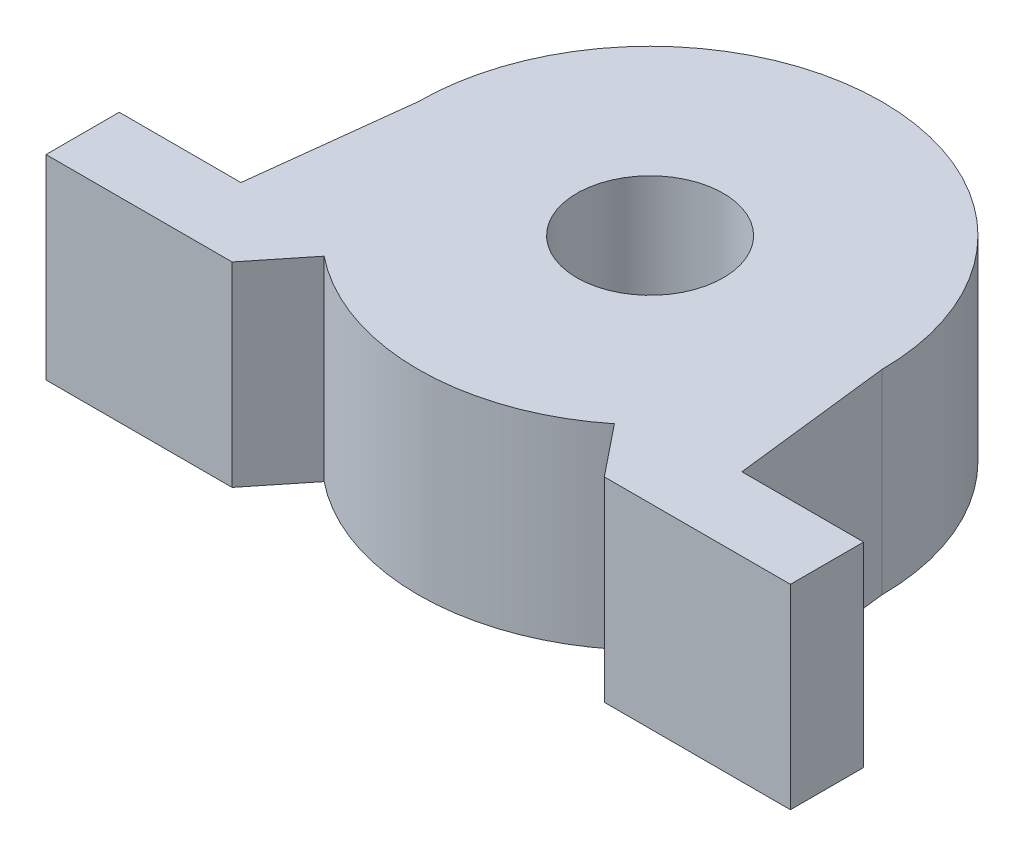
ISO-10303-21;
HEADER;
FILE_DESCRIPTION(('STEP AP214'),'2;1');
FILE_NAME('part.step','',(''),(''),'','','');
FILE_SCHEMA(('AUTOMOTIVE_DESIGN { 1 0 10303 214 1 1 1 1 }'));
ENDSEC;
DATA;
#1=APPLICATION_CONTEXT('core data for automotive mechanical design processes');
#2=APPLICATION_PROTOCOL_DEFINITION('international standard','automotive_design',2000,#1);
#3=PRODUCT_CONTEXT('',#1,'mechanical');
#4=PRODUCT('Part','Part','',(#3));
#5=PRODUCT_RELATED_PRODUCT_CATEGORY('part','',(#4));
#6=PRODUCT_DEFINITION_FORMATION('','',#4);
#7=PRODUCT_DEFINITION_CONTEXT('part definition',#1,'design');
#8=PRODUCT_DEFINITION('design','',#6,#7);
#9=PRODUCT_DEFINITION_SHAPE('','',#8);
#10=(LENGTH_UNIT() NAMED_UNIT(*) SI_UNIT(.MILLI.,.METRE.));
#11=(NAMED_UNIT(*) PLANE_ANGLE_UNIT() SI_UNIT($,.RADIAN.));
#12=(NAMED_UNIT(*) SI_UNIT($,.STERADIAN.) SOLID_ANGLE_UNIT());
#13=UNCERTAINTY_MEASURE_WITH_UNIT(LENGTH_MEASURE(1.E-05),#10,'distance_accuracy_value','');
#14=(GEOMETRIC_REPRESENTATION_CONTEXT(3) GLOBAL_UNCERTAINTY_ASSIGNED_CONTEXT((#13)) GLOBAL_UNIT_ASSIGNED_CONTEXT((#10,
#11,#12)) REPRESENTATION_CONTEXT('',''));
#15=CARTESIAN_POINT('',(0.,0.,0.));
#16=DIRECTION('',(0.,0.,1.));
#17=DIRECTION('',(1.,0.,0.));
#18=AXIS2_PLACEMENT_3D('',#15,#16,#17);
#19=CARTESIAN_POINT('',(0.,16.,0.));
#20=DIRECTION('',(0.,1.,0.));
#21=DIRECTION('',(0.,0.,1.));
#22=AXIS2_PLACEMENT_3D('',#19,#20,#21);
#23=PLANE('',#22);
#24=DIRECTION('',(0.,0.,1.));
#25=VECTOR('',#24,1.);
#26=CARTESIAN_POINT('',(-30.5,16.,19.));
#27=LINE('',#26,#25);
#28=CARTESIAN_POINT('',(-30.5,16.,13.));
#29=VERTEX_POINT('',#28);
#30=CARTESIAN_POINT('',(-30.5,16.,19.));
#31=VERTEX_POINT('',#30);
#32=EDGE_CURVE('E176',#29,#31,#27,.T.);
#33=ORIENTED_EDGE('',*,*,#32,.T.);
#34=DIRECTION('',(1.,0.,0.));
#35=VECTOR('',#34,1.);
#36=CARTESIAN_POINT('',(-15.25,16.,19.));
#37=LINE('',#36,#35);
#38=CARTESIAN_POINT('',(-15.25,16.,19.));
#39=VERTEX_POINT('',#38);
#40=EDGE_CURVE('E104',#31,#39,#37,.T.);
#41=ORIENTED_EDGE('',*,*,#40,.T.);
#42=DIRECTION('',(0.625945636097312,0.,-0.779866694154028));
#43=VECTOR('',#42,1.);
#44=CARTESIAN_POINT('',(-15.25,16.,19.));
#45=LINE('',#44,#43);
#46=CARTESIAN_POINT('',(-11.8929670858489,16.,14.8174671889265));
#47=VERTEX_POINT('',#46);
#48=EDGE_CURVE('E203',#39,#47,#45,.T.);
#49=ORIENTED_EDGE('',*,*,#48,.T.);
#50=CARTESIAN_POINT('',(0.,16.,0.));
#51=DIRECTION('',(0.,1.,0.));
#52=DIRECTION('',(0.,0.,1.));
#53=AXIS2_PLACEMENT_3D('',#50,#51,#52);
#54=CIRCLE('',#53,19.);
#55=CARTESIAN_POINT('',(11.8929670858492,16.,14.8174671889263));
#56=VERTEX_POINT('',#55);
#57=EDGE_CURVE('E222',#47,#56,#54,.T.);
#58=ORIENTED_EDGE('',*,*,#57,.T.);
#59=DIRECTION('',(0.625945636097322,0.,0.779866694154019));
#60=VECTOR('',#59,1.);
#61=CARTESIAN_POINT('',(15.2500000000004,16.,18.9999999999998));
#62=LINE('',#61,#60);
#63=CARTESIAN_POINT('',(15.2500000000004,16.,18.9999999999998));
#64=VERTEX_POINT('',#63);
#65=EDGE_CURVE('E219',#56,#64,#62,.T.);
#66=ORIENTED_EDGE('',*,*,#65,.T.);
#67=DIRECTION('',(1.,0.,0.));
#68=VECTOR('',#67,1.);
#69=CARTESIAN_POINT('',(15.2500000000004,16.,18.9999999999998));
#70=LINE('',#69,#68);
#71=CARTESIAN_POINT('',(30.5000000000004,16.,18.9999999999996));
#72=VERTEX_POINT('',#71);
#73=EDGE_CURVE('E221',#64,#72,#70,.T.);
#74=ORIENTED_EDGE('',*,*,#73,.T.);
#75=DIRECTION('',(0.,0.,-1.));
#76=VECTOR('',#75,1.);
#77=CARTESIAN_POINT('',(30.5000000000004,16.,18.9999999999996));
#78=LINE('',#77,#76);
#79=CARTESIAN_POINT('',(30.5000000000003,16.,12.9999999999996));
#80=VERTEX_POINT('',#79);
#81=EDGE_CURVE('E224',#72,#80,#78,.T.);
#82=ORIENTED_EDGE('',*,*,#81,.T.);
#83=DIRECTION('',(-1.,0.,0.));
#84=VECTOR('',#83,1.);
#85=CARTESIAN_POINT('',(30.5000000000003,16.,12.9999999999996));
#86=LINE('',#85,#84);
#87=CARTESIAN_POINT('',(20.5242909179374,16.,12.9999999999997));
#88=VERTEX_POINT('',#87);
#89=EDGE_CURVE('E230',#80,#88,#86,.T.);
#90=ORIENTED_EDGE('',*,*,#89,.T.);
#91=DIRECTION('',(-0.116455348697077,0.,-0.993195928183278));
#92=VECTOR('',#91,1.);
#93=CARTESIAN_POINT('',(20.5242909179374,16.,12.9999999999997));
#94=LINE('',#93,#92);
#95=CARTESIAN_POINT('',(19.0000000000001,16.,-2.63677968348475E-13));
#96=VERTEX_POINT('',#95);
#97=EDGE_CURVE('E135',#88,#96,#94,.T.);
#98=ORIENTED_EDGE('',*,*,#97,.T.);
#99=CARTESIAN_POINT('',(0.,16.,0.));
#100=DIRECTION('',(0.,1.,0.));
#101=DIRECTION('',(0.,0.,1.));
#102=AXIS2_PLACEMENT_3D('',#99,#100,#101);
#103=CIRCLE('',#102,19.0000000000001);
#104=CARTESIAN_POINT('',(-19.0000000000001,16.,0.));
#105=VERTEX_POINT('',#104);
#106=EDGE_CURVE('E129',#96,#105,#103,.T.);
#107=ORIENTED_EDGE('',*,*,#106,.T.);
#108=DIRECTION('',(-0.116455348697063,0.,0.993195928183279));
#109=VECTOR('',#108,1.);
#110=CARTESIAN_POINT('',(-20.524290917937,16.,13.));
#111=LINE('',#110,#109);
#112=CARTESIAN_POINT('',(-20.524290917937,16.,13.));
#113=VERTEX_POINT('',#112);
#114=EDGE_CURVE('E133',#105,#113,#111,.T.);
#115=ORIENTED_EDGE('',*,*,#114,.T.);
#116=DIRECTION('',(-1.,0.,0.));
#117=VECTOR('',#116,1.);
#118=CARTESIAN_POINT('',(-30.5,16.,13.));
#119=LINE('',#118,#117);
#120=EDGE_CURVE('E49',#113,#29,#119,.T.);
#121=ORIENTED_EDGE('',*,*,#120,.T.);
#122=EDGE_LOOP('',(#33,#41,#49,#58,#66,#74,#82,#90,#98,#107,#115,#121));
#123=FACE_BOUND('',#122,.T.);
#124=CARTESIAN_POINT('',(0.,16.,0.));
#125=DIRECTION('',(0.,1.,0.));
#126=DIRECTION('',(0.,0.,1.));
#127=AXIS2_PLACEMENT_3D('',#124,#125,#126);
#128=CIRCLE('',#127,6.);
#129=CARTESIAN_POINT('',(0.,16.,6.));
#130=VERTEX_POINT('',#129);
#131=EDGE_CURVE('E157',#130,#130,#128,.T.);
#132=ORIENTED_EDGE('',*,*,#131,.F.);
#133=EDGE_LOOP('',(#132));
#134=FACE_BOUND('',#133,.T.);
#135=ADVANCED_FACE('F32',(#123,#134),#23,.T.);
#136=CARTESIAN_POINT('',(0.,0.,0.));
#137=DIRECTION('',(0.,1.,0.));
#138=DIRECTION('',(0.,0.,1.));
#139=AXIS2_PLACEMENT_3D('',#136,#137,#138);
#140=PLANE('',#139);
#141=DIRECTION('',(0.,0.,1.));
#142=VECTOR('',#141,1.);
#143=CARTESIAN_POINT('',(-30.5,0.,19.));
#144=LINE('',#143,#142);
#145=CARTESIAN_POINT('',(-30.5,0.,13.));
#146=VERTEX_POINT('',#145);
#147=CARTESIAN_POINT('',(-30.5,0.,19.));
#148=VERTEX_POINT('',#147);
#149=EDGE_CURVE('E153',#146,#148,#144,.T.);
#150=ORIENTED_EDGE('',*,*,#149,.F.);
#151=DIRECTION('',(-1.,0.,0.));
#152=VECTOR('',#151,1.);
#153=CARTESIAN_POINT('',(-30.5,0.,13.));
#154=LINE('',#153,#152);
#155=CARTESIAN_POINT('',(-20.524290917937,0.,13.));
#156=VERTEX_POINT('',#155);
#157=EDGE_CURVE('E96',#156,#146,#154,.T.);
#158=ORIENTED_EDGE('',*,*,#157,.F.);
#159=DIRECTION('',(-0.116455348697063,0.,0.993195928183279));
#160=VECTOR('',#159,1.);
#161=CARTESIAN_POINT('',(-20.524290917937,0.,13.));
#162=LINE('',#161,#160);
#163=CARTESIAN_POINT('',(-19.0000000000001,0.,0.));
#164=VERTEX_POINT('',#163);
#165=EDGE_CURVE('E90',#164,#156,#162,.T.);
#166=ORIENTED_EDGE('',*,*,#165,.F.);
#167=CARTESIAN_POINT('',(0.,0.,0.));
#168=DIRECTION('',(0.,1.,0.));
#169=DIRECTION('',(0.,0.,1.));
#170=AXIS2_PLACEMENT_3D('',#167,#168,#169);
#171=CIRCLE('',#170,19.0000000000001);
#172=CARTESIAN_POINT('',(19.0000000000001,0.,-2.63677968348475E-13));
#173=VERTEX_POINT('',#172);
#174=EDGE_CURVE('E143',#173,#164,#171,.T.);
#175=ORIENTED_EDGE('',*,*,#174,.F.);
#176=DIRECTION('',(-0.116455348697077,0.,-0.993195928183278));
#177=VECTOR('',#176,1.);
#178=CARTESIAN_POINT('',(20.5242909179374,0.,12.9999999999997));
#179=LINE('',#178,#177);
#180=CARTESIAN_POINT('',(20.5242909179374,0.,12.9999999999997));
#181=VERTEX_POINT('',#180);
#182=EDGE_CURVE('E171',#181,#173,#179,.T.);
#183=ORIENTED_EDGE('',*,*,#182,.F.);
#184=DIRECTION('',(-1.,0.,0.));
#185=VECTOR('',#184,1.);
#186=CARTESIAN_POINT('',(30.5000000000003,0.,12.9999999999996));
#187=LINE('',#186,#185);
#188=CARTESIAN_POINT('',(30.5000000000003,0.,12.9999999999996));
#189=VERTEX_POINT('',#188);
#190=EDGE_CURVE('E169',#189,#181,#187,.T.);
#191=ORIENTED_EDGE('',*,*,#190,.F.);
#192=DIRECTION('',(0.,0.,-1.));
#193=VECTOR('',#192,1.);
#194=CARTESIAN_POINT('',(30.5000000000004,0.,18.9999999999996));
#195=LINE('',#194,#193);
#196=CARTESIAN_POINT('',(30.5000000000004,0.,18.9999999999996));
#197=VERTEX_POINT('',#196);
#198=EDGE_CURVE('E167',#197,#189,#195,.T.);
#199=ORIENTED_EDGE('',*,*,#198,.F.);
#200=DIRECTION('',(1.,0.,0.));
#201=VECTOR('',#200,1.);
#202=CARTESIAN_POINT('',(15.2500000000004,0.,18.9999999999998));
#203=LINE('',#202,#201);
#204=CARTESIAN_POINT('',(15.2500000000004,0.,18.9999999999998));
#205=VERTEX_POINT('',#204);
#206=EDGE_CURVE('E165',#205,#197,#203,.T.);
#207=ORIENTED_EDGE('',*,*,#206,.F.);
#208=DIRECTION('',(0.625945636097322,0.,0.779866694154019));
#209=VECTOR('',#208,1.);
#210=CARTESIAN_POINT('',(15.2500000000004,0.,18.9999999999998));
#211=LINE('',#210,#209);
#212=CARTESIAN_POINT('',(11.8929670858492,0.,14.8174671889263));
#213=VERTEX_POINT('',#212);
#214=EDGE_CURVE('E163',#213,#205,#211,.T.);
#215=ORIENTED_EDGE('',*,*,#214,.F.);
#216=CARTESIAN_POINT('',(0.,0.,0.));
#217=DIRECTION('',(0.,1.,0.));
#218=DIRECTION('',(0.,0.,1.));
#219=AXIS2_PLACEMENT_3D('',#216,#217,#218);
#220=CIRCLE('',#219,19.);
#221=CARTESIAN_POINT('',(-11.8929670858489,0.,14.8174671889265));
#222=VERTEX_POINT('',#221);
#223=EDGE_CURVE('E161',#222,#213,#220,.T.);
#224=ORIENTED_EDGE('',*,*,#223,.F.);
#225=DIRECTION('',(0.625945636097312,0.,-0.779866694154028));
#226=VECTOR('',#225,1.);
#227=CARTESIAN_POINT('',(-15.25,0.,19.));
#228=LINE('',#227,#226);
#229=CARTESIAN_POINT('',(-15.25,0.,19.));
#230=VERTEX_POINT('',#229);
#231=EDGE_CURVE('E159',#230,#222,#228,.T.);
#232=ORIENTED_EDGE('',*,*,#231,.F.);
#233=DIRECTION('',(1.,0.,0.));
#234=VECTOR('',#233,1.);
#235=CARTESIAN_POINT('',(-15.25,0.,19.));
#236=LINE('',#235,#234);
#237=EDGE_CURVE('E156',#148,#230,#236,.T.);
#238=ORIENTED_EDGE('',*,*,#237,.F.);
#239=EDGE_LOOP('',(#150,#158,#166,#175,#183,#191,#199,#207,#215,#224,#232,#238));
#240=FACE_BOUND('',#239,.T.);
#241=CARTESIAN_POINT('',(0.,0.,0.));
#242=DIRECTION('',(0.,1.,0.));
#243=DIRECTION('',(0.,0.,1.));
#244=AXIS2_PLACEMENT_3D('',#241,#242,#243);
#245=CIRCLE('',#244,6.);
#246=CARTESIAN_POINT('',(0.,0.,6.));
#247=VERTEX_POINT('',#246);
#248=EDGE_CURVE('E377',#247,#247,#245,.T.);
#249=ORIENTED_EDGE('',*,*,#248,.T.);
#250=EDGE_LOOP('',(#249));
#251=FACE_BOUND('',#250,.T.);
#252=ADVANCED_FACE('F207',(#240,#251),#140,.F.);
#253=CARTESIAN_POINT('',(-30.5,16.,19.));
#254=DIRECTION('',(1.,0.,0.));
#255=DIRECTION('',(0.,0.,-1.));
#256=AXIS2_PLACEMENT_3D('',#253,#254,#255);
#257=PLANE('',#256);
#258=ORIENTED_EDGE('',*,*,#149,.T.);
#259=DIRECTION('',(0.,-1.,0.));
#260=VECTOR('',#259,1.);
#261=CARTESIAN_POINT('',(-30.5,16.,19.));
#262=LINE('',#261,#260);
#263=EDGE_CURVE('E11',#31,#148,#262,.T.);
#264=ORIENTED_EDGE('',*,*,#263,.F.);
#265=ORIENTED_EDGE('',*,*,#32,.F.);
#266=DIRECTION('',(0.,-1.,0.));
#267=VECTOR('',#266,1.);
#268=CARTESIAN_POINT('',(-30.5,16.,13.));
#269=LINE('',#268,#267);
#270=EDGE_CURVE('E149',#29,#146,#269,.T.);
#271=ORIENTED_EDGE('',*,*,#270,.T.);
#272=EDGE_LOOP('',(#258,#264,#265,#271));
#273=FACE_BOUND('',#272,.T.);
#274=ADVANCED_FACE('F34',(#273),#257,.F.);
#275=CARTESIAN_POINT('',(-15.25,16.,19.));
#276=DIRECTION('',(0.,0.,-1.));
#277=DIRECTION('',(-1.,0.,0.));
#278=AXIS2_PLACEMENT_3D('',#275,#276,#277);
#279=PLANE('',#278);
#280=ORIENTED_EDGE('',*,*,#237,.T.);
#281=DIRECTION('',(0.,-1.,0.));
#282=VECTOR('',#281,1.);
#283=CARTESIAN_POINT('',(-15.25,16.,19.));
#284=LINE('',#283,#282);
#285=EDGE_CURVE('E41',#39,#230,#284,.T.);
#286=ORIENTED_EDGE('',*,*,#285,.F.);
#287=ORIENTED_EDGE('',*,*,#40,.F.);
#288=ORIENTED_EDGE('',*,*,#263,.T.);
#289=EDGE_LOOP('',(#280,#286,#287,#288));
#290=FACE_BOUND('',#289,.T.);
#291=ADVANCED_FACE('F264',(#290),#279,.F.);
#292=CARTESIAN_POINT('',(-15.25,16.,19.));
#293=DIRECTION('',(-0.779866694154028,0.,-0.625945636097312));
#294=DIRECTION('',(-0.625945636097312,0.,0.779866694154028));
#295=AXIS2_PLACEMENT_3D('',#292,#293,#294);
#296=PLANE('',#295);
#297=ORIENTED_EDGE('',*,*,#231,.T.);
#298=DIRECTION('',(0.,-1.,0.));
#299=VECTOR('',#298,1.);
#300=CARTESIAN_POINT('',(-11.8929670858489,16.,14.8174671889265));
#301=LINE('',#300,#299);
#302=EDGE_CURVE('E195',#47,#222,#301,.T.);
#303=ORIENTED_EDGE('',*,*,#302,.F.);
#304=ORIENTED_EDGE('',*,*,#48,.F.);
#305=ORIENTED_EDGE('',*,*,#285,.T.);
#306=EDGE_LOOP('',(#297,#303,#304,#305));
#307=FACE_BOUND('',#306,.T.);
#308=ADVANCED_FACE('F201',(#307),#296,.F.);
#309=CARTESIAN_POINT('',(0.,16.,0.));
#310=DIRECTION('',(0.,-1.,0.));
#311=DIRECTION('',(0.,0.,-1.));
#312=AXIS2_PLACEMENT_3D('',#309,#310,#311);
#313=CYLINDRICAL_SURFACE('',#312,19.);
#314=ORIENTED_EDGE('',*,*,#223,.T.);
#315=DIRECTION('',(0.,-1.,0.));
#316=VECTOR('',#315,1.);
#317=CARTESIAN_POINT('',(11.8929670858492,16.,14.8174671889263));
#318=LINE('',#317,#316);
#319=EDGE_CURVE('E192',#56,#213,#318,.T.);
#320=ORIENTED_EDGE('',*,*,#319,.F.);
#321=ORIENTED_EDGE('',*,*,#57,.F.);
#322=ORIENTED_EDGE('',*,*,#302,.T.);
#323=EDGE_LOOP('',(#314,#320,#321,#322));
#324=FACE_BOUND('',#323,.T.);
#325=ADVANCED_FACE('F213',(#324),#313,.T.);
#326=CARTESIAN_POINT('',(15.2500000000004,16.,18.9999999999998));
#327=DIRECTION('',(0.779866694154019,0.,-0.625945636097322));
#328=DIRECTION('',(-0.625945636097322,0.,-0.779866694154019));
#329=AXIS2_PLACEMENT_3D('',#326,#327,#328);
#330=PLANE('',#329);
#331=ORIENTED_EDGE('',*,*,#214,.T.);
#332=DIRECTION('',(0.,-1.,0.));
#333=VECTOR('',#332,1.);
#334=CARTESIAN_POINT('',(15.2500000000004,16.,18.9999999999998));
#335=LINE('',#334,#333);
#336=EDGE_CURVE('E189',#64,#205,#335,.T.);
#337=ORIENTED_EDGE('',*,*,#336,.F.);
#338=ORIENTED_EDGE('',*,*,#65,.F.);
#339=ORIENTED_EDGE('',*,*,#319,.T.);
#340=EDGE_LOOP('',(#331,#337,#338,#339));
#341=FACE_BOUND('',#340,.T.);
#342=ADVANCED_FACE('F217',(#341),#330,.F.);
#343=CARTESIAN_POINT('',(15.2500000000004,16.,18.9999999999998));
#344=DIRECTION('',(0.,0.,-1.));
#345=DIRECTION('',(-1.,0.,0.));
#346=AXIS2_PLACEMENT_3D('',#343,#344,#345);
#347=PLANE('',#346);
#348=ORIENTED_EDGE('',*,*,#206,.T.);
#349=DIRECTION('',(0.,-1.,0.));
#350=VECTOR('',#349,1.);
#351=CARTESIAN_POINT('',(30.5000000000004,16.,18.9999999999996));
#352=LINE('',#351,#350);
#353=EDGE_CURVE('E186',#72,#197,#352,.T.);
#354=ORIENTED_EDGE('',*,*,#353,.F.);
#355=ORIENTED_EDGE('',*,*,#73,.F.);
#356=ORIENTED_EDGE('',*,*,#336,.T.);
#357=EDGE_LOOP('',(#348,#354,#355,#356));
#358=FACE_BOUND('',#357,.T.);
#359=ADVANCED_FACE('F277',(#358),#347,.F.);
#360=CARTESIAN_POINT('',(30.5000000000004,16.,18.9999999999996));
#361=DIRECTION('',(-1.,0.,0.));
#362=DIRECTION('',(0.,0.,1.));
#363=AXIS2_PLACEMENT_3D('',#360,#361,#362);
#364=PLANE('',#363);
#365=ORIENTED_EDGE('',*,*,#198,.T.);
#366=DIRECTION('',(0.,-1.,0.));
#367=VECTOR('',#366,1.);
#368=CARTESIAN_POINT('',(30.5000000000003,16.,12.9999999999996));
#369=LINE('',#368,#367);
#370=EDGE_CURVE('E183',#80,#189,#369,.T.);
#371=ORIENTED_EDGE('',*,*,#370,.F.);
#372=ORIENTED_EDGE('',*,*,#81,.F.);
#373=ORIENTED_EDGE('',*,*,#353,.T.);
#374=EDGE_LOOP('',(#365,#371,#372,#373));
#375=FACE_BOUND('',#374,.T.);
#376=ADVANCED_FACE('F280',(#375),#364,.F.);
#377=CARTESIAN_POINT('',(30.5000000000003,16.,12.9999999999996));
#378=DIRECTION('',(0.,0.,1.));
#379=DIRECTION('',(1.,0.,0.));
#380=AXIS2_PLACEMENT_3D('',#377,#378,#379);
#381=PLANE('',#380);
#382=ORIENTED_EDGE('',*,*,#190,.T.);
#383=DIRECTION('',(0.,-1.,0.));
#384=VECTOR('',#383,1.);
#385=CARTESIAN_POINT('',(20.5242909179374,16.,12.9999999999997));
#386=LINE('',#385,#384);
#387=EDGE_CURVE('E180',#88,#181,#386,.T.);
#388=ORIENTED_EDGE('',*,*,#387,.F.);
#389=ORIENTED_EDGE('',*,*,#89,.F.);
#390=ORIENTED_EDGE('',*,*,#370,.T.);
#391=EDGE_LOOP('',(#382,#388,#389,#390));
#392=FACE_BOUND('',#391,.T.);
#393=ADVANCED_FACE('F236',(#392),#381,.F.);
#394=CARTESIAN_POINT('',(20.5242909179374,16.,12.9999999999997));
#395=DIRECTION('',(-0.993195928183278,0.,0.116455348697077));
#396=DIRECTION('',(0.116455348697077,0.,0.993195928183278));
#397=AXIS2_PLACEMENT_3D('',#394,#395,#396);
#398=PLANE('',#397);
#399=ORIENTED_EDGE('',*,*,#182,.T.);
#400=DIRECTION('',(0.,-1.,0.));
#401=VECTOR('',#400,1.);
#402=CARTESIAN_POINT('',(19.0000000000001,16.,-2.63677968348475E-13));
#403=LINE('',#402,#401);
#404=EDGE_CURVE('E144',#96,#173,#403,.T.);
#405=ORIENTED_EDGE('',*,*,#404,.F.);
#406=ORIENTED_EDGE('',*,*,#97,.F.);
#407=ORIENTED_EDGE('',*,*,#387,.T.);
#408=EDGE_LOOP('',(#399,#405,#406,#407));
#409=FACE_BOUND('',#408,.T.);
#410=ADVANCED_FACE('F240',(#409),#398,.F.);
#411=CARTESIAN_POINT('',(0.,16.,0.));
#412=DIRECTION('',(0.,-1.,0.));
#413=DIRECTION('',(0.,0.,-1.));
#414=AXIS2_PLACEMENT_3D('',#411,#412,#413);
#415=CYLINDRICAL_SURFACE('',#414,19.0000000000001);
#416=ORIENTED_EDGE('',*,*,#174,.T.);
#417=DIRECTION('',(0.,-1.,0.));
#418=VECTOR('',#417,1.);
#419=CARTESIAN_POINT('',(-19.0000000000001,16.,0.));
#420=LINE('',#419,#418);
#421=EDGE_CURVE('E140',#105,#164,#420,.T.);
#422=ORIENTED_EDGE('',*,*,#421,.F.);
#423=ORIENTED_EDGE('',*,*,#106,.F.);
#424=ORIENTED_EDGE('',*,*,#404,.T.);
#425=EDGE_LOOP('',(#416,#422,#423,#424));
#426=FACE_BOUND('',#425,.T.);
#427=ADVANCED_FACE('F141',(#426),#415,.T.);
#428=CARTESIAN_POINT('',(-20.524290917937,16.,13.));
#429=DIRECTION('',(0.993195928183279,0.,0.116455348697063));
#430=DIRECTION('',(0.116455348697063,0.,-0.993195928183279));
#431=AXIS2_PLACEMENT_3D('',#428,#429,#430);
#432=PLANE('',#431);
#433=ORIENTED_EDGE('',*,*,#165,.T.);
#434=DIRECTION('',(0.,-1.,0.));
#435=VECTOR('',#434,1.);
#436=CARTESIAN_POINT('',(-20.524290917937,16.,13.));
#437=LINE('',#436,#435);
#438=EDGE_CURVE('E145',#113,#156,#437,.T.);
#439=ORIENTED_EDGE('',*,*,#438,.F.);
#440=ORIENTED_EDGE('',*,*,#114,.F.);
#441=ORIENTED_EDGE('',*,*,#421,.T.);
#442=EDGE_LOOP('',(#433,#439,#440,#441));
#443=FACE_BOUND('',#442,.T.);
#444=ADVANCED_FACE('F147',(#443),#432,.F.);
#445=CARTESIAN_POINT('',(-30.5,16.,13.));
#446=DIRECTION('',(0.,0.,1.));
#447=DIRECTION('',(1.,0.,0.));
#448=AXIS2_PLACEMENT_3D('',#445,#446,#447);
#449=PLANE('',#448);
#450=ORIENTED_EDGE('',*,*,#157,.T.);
#451=ORIENTED_EDGE('',*,*,#270,.F.);
#452=ORIENTED_EDGE('',*,*,#120,.F.);
#453=ORIENTED_EDGE('',*,*,#438,.T.);
#454=EDGE_LOOP('',(#450,#451,#452,#453));
#455=FACE_BOUND('',#454,.T.);
#456=ADVANCED_FACE('F244',(#455),#449,.F.);
#457=CARTESIAN_POINT('',(0.,16.,0.));
#458=DIRECTION('',(0.,-1.,0.));
#459=DIRECTION('',(0.,0.,-1.));
#460=AXIS2_PLACEMENT_3D('',#457,#458,#459);
#461=CYLINDRICAL_SURFACE('',#460,6.);
#462=ORIENTED_EDGE('',*,*,#131,.T.);
#463=EDGE_LOOP('',(#462));
#464=FACE_BOUND('',#463,.T.);
#465=ORIENTED_EDGE('',*,*,#248,.F.);
#466=EDGE_LOOP('',(#465));
#467=FACE_BOUND('',#466,.T.);
#468=ADVANCED_FACE('F246',(#464,#467),#461,.F.);
#469=CLOSED_SHELL('',(#135,#252,#274,#291,#308,#325,#342,#359,#376,#393,#410,#427,#444,#456,#468));
#470=MANIFOLD_SOLID_BREP('B2',#469);
#471=ADVANCED_BREP_SHAPE_REPRESENTATION('',(#18,#470),#14);
#472=SHAPE_DEFINITION_REPRESENTATION(#9,#471);
ENDSEC;
END-ISO-10303-21;
